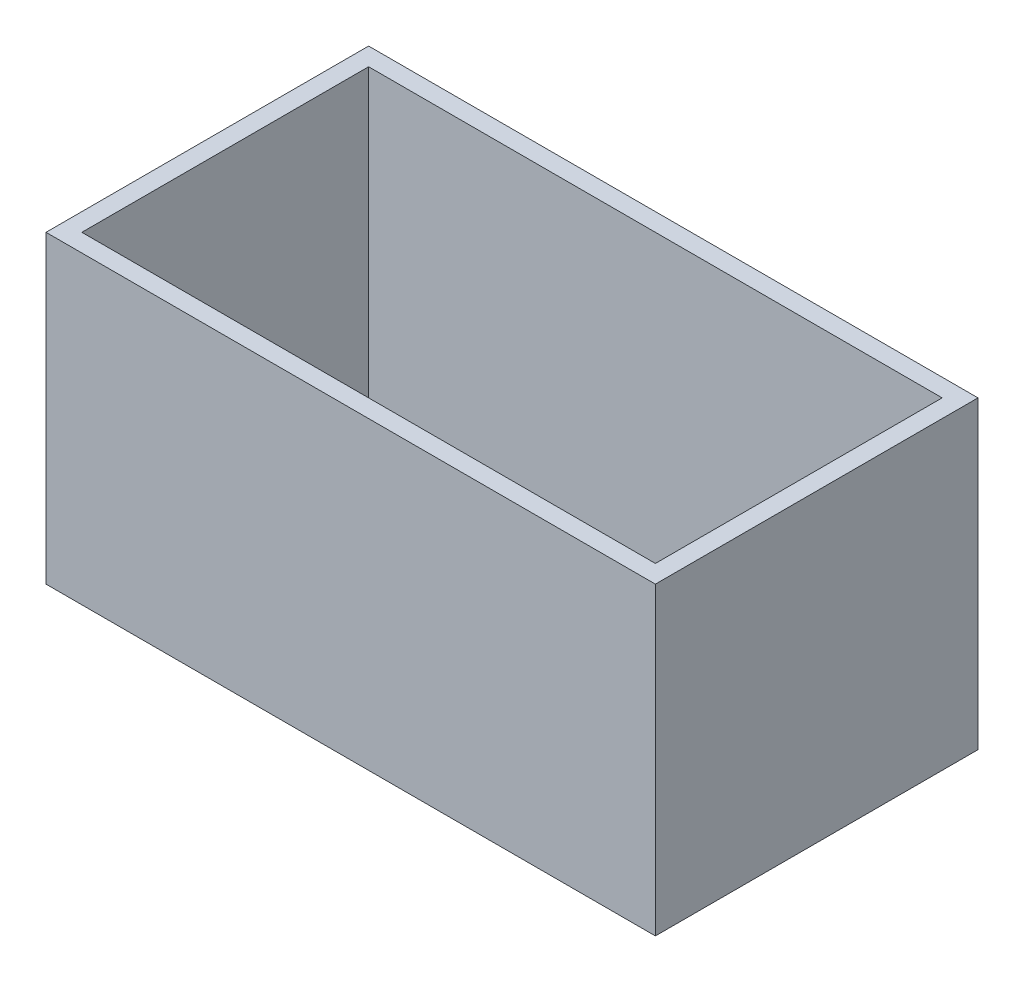
ISO-10303-21;
HEADER;
FILE_DESCRIPTION(('STEP AP214'),'2;1');
FILE_NAME('part.step','',(''),(''),'','','');
FILE_SCHEMA(('AUTOMOTIVE_DESIGN { 1 0 10303 214 1 1 1 1 }'));
ENDSEC;
DATA;
#1=APPLICATION_CONTEXT('core data for automotive mechanical design processes');
#2=APPLICATION_PROTOCOL_DEFINITION('international standard','automotive_design',2000,#1);
#3=PRODUCT_CONTEXT('',#1,'mechanical');
#4=PRODUCT('Part','Part','',(#3));
#5=PRODUCT_RELATED_PRODUCT_CATEGORY('part','',(#4));
#6=PRODUCT_DEFINITION_FORMATION('','',#4);
#7=PRODUCT_DEFINITION_CONTEXT('part definition',#1,'design');
#8=PRODUCT_DEFINITION('design','',#6,#7);
#9=PRODUCT_DEFINITION_SHAPE('','',#8);
#10=(LENGTH_UNIT() NAMED_UNIT(*) SI_UNIT(.MILLI.,.METRE.));
#11=(NAMED_UNIT(*) PLANE_ANGLE_UNIT() SI_UNIT($,.RADIAN.));
#12=(NAMED_UNIT(*) SI_UNIT($,.STERADIAN.) SOLID_ANGLE_UNIT());
#13=UNCERTAINTY_MEASURE_WITH_UNIT(LENGTH_MEASURE(1.E-05),#10,'distance_accuracy_value','');
#14=(GEOMETRIC_REPRESENTATION_CONTEXT(3) GLOBAL_UNCERTAINTY_ASSIGNED_CONTEXT((#13)) GLOBAL_UNIT_ASSIGNED_CONTEXT((#10,
#11,#12)) REPRESENTATION_CONTEXT('',''));
#15=CARTESIAN_POINT('',(0.,0.,0.));
#16=DIRECTION('',(0.,0.,1.));
#17=DIRECTION('',(1.,0.,0.));
#18=AXIS2_PLACEMENT_3D('',#15,#16,#17);
#19=CARTESIAN_POINT('',(0.,323.85,0.));
#20=DIRECTION('',(0.,-1.,0.));
#21=DIRECTION('',(0.,0.,-1.));
#22=AXIS2_PLACEMENT_3D('',#19,#20,#21);
#23=PLANE('',#22);
#24=DIRECTION('',(1.,0.,0.));
#25=VECTOR('',#24,1.);
#26=CARTESIAN_POINT('',(-323.85,323.85,171.45));
#27=LINE('',#26,#25);
#28=CARTESIAN_POINT('',(-323.85,323.85,171.45));
#29=VERTEX_POINT('',#28);
#30=CARTESIAN_POINT('',(323.85,323.85,171.45));
#31=VERTEX_POINT('',#30);
#32=EDGE_CURVE('E89',#29,#31,#27,.T.);
#33=ORIENTED_EDGE('',*,*,#32,.T.);
#34=DIRECTION('',(0.,0.,1.));
#35=VECTOR('',#34,1.);
#36=CARTESIAN_POINT('',(323.85,323.85,-171.45));
#37=LINE('',#36,#35);
#38=CARTESIAN_POINT('',(323.85,323.85,-171.45));
#39=VERTEX_POINT('',#38);
#40=EDGE_CURVE('E167',#39,#31,#37,.T.);
#41=ORIENTED_EDGE('',*,*,#40,.F.);
#42=DIRECTION('',(1.,0.,0.));
#43=VECTOR('',#42,1.);
#44=CARTESIAN_POINT('',(-323.85,323.85,-171.45));
#45=LINE('',#44,#43);
#46=CARTESIAN_POINT('',(-323.85,323.85,-171.45));
#47=VERTEX_POINT('',#46);
#48=EDGE_CURVE('E171',#47,#39,#45,.T.);
#49=ORIENTED_EDGE('',*,*,#48,.F.);
#50=DIRECTION('',(0.,0.,1.));
#51=VECTOR('',#50,1.);
#52=CARTESIAN_POINT('',(-323.85,323.85,-171.45));
#53=LINE('',#52,#51);
#54=EDGE_CURVE('E64',#47,#29,#53,.T.);
#55=ORIENTED_EDGE('',*,*,#54,.T.);
#56=EDGE_LOOP('',(#33,#41,#49,#55));
#57=FACE_BOUND('',#56,.T.);
#58=DIRECTION('',(1.,0.,0.));
#59=VECTOR('',#58,1.);
#60=CARTESIAN_POINT('',(0.,323.85,152.4));
#61=LINE('',#60,#59);
#62=CARTESIAN_POINT('',(-304.8,323.85,152.4));
#63=VERTEX_POINT('',#62);
#64=CARTESIAN_POINT('',(304.8,323.85,152.4));
#65=VERTEX_POINT('',#64);
#66=EDGE_CURVE('E119',#63,#65,#61,.T.);
#67=ORIENTED_EDGE('',*,*,#66,.F.);
#68=DIRECTION('',(0.,0.,1.));
#69=VECTOR('',#68,1.);
#70=CARTESIAN_POINT('',(-304.8,323.85,0.));
#71=LINE('',#70,#69);
#72=CARTESIAN_POINT('',(-304.8,323.85,-152.4));
#73=VERTEX_POINT('',#72);
#74=EDGE_CURVE('E162',#73,#63,#71,.T.);
#75=ORIENTED_EDGE('',*,*,#74,.F.);
#76=DIRECTION('',(1.,0.,0.));
#77=VECTOR('',#76,1.);
#78=CARTESIAN_POINT('',(0.,323.85,-152.4));
#79=LINE('',#78,#77);
#80=CARTESIAN_POINT('',(304.8,323.85,-152.4));
#81=VERTEX_POINT('',#80);
#82=EDGE_CURVE('E55',#73,#81,#79,.T.);
#83=ORIENTED_EDGE('',*,*,#82,.T.);
#84=DIRECTION('',(0.,0.,1.));
#85=VECTOR('',#84,1.);
#86=CARTESIAN_POINT('',(304.8,323.85,0.));
#87=LINE('',#86,#85);
#88=EDGE_CURVE('E157',#81,#65,#87,.T.);
#89=ORIENTED_EDGE('',*,*,#88,.T.);
#90=EDGE_LOOP('',(#67,#75,#83,#89));
#91=FACE_BOUND('',#90,.T.);
#92=ADVANCED_FACE('F39',(#57,#91),#23,.F.);
#93=CARTESIAN_POINT('',(-323.85,323.85,171.45));
#94=DIRECTION('',(0.,0.,-1.));
#95=DIRECTION('',(-1.,0.,0.));
#96=AXIS2_PLACEMENT_3D('',#93,#94,#95);
#97=PLANE('',#96);
#98=DIRECTION('',(1.,0.,0.));
#99=VECTOR('',#98,1.);
#100=CARTESIAN_POINT('',(-323.85,0.,171.45));
#101=LINE('',#100,#99);
#102=CARTESIAN_POINT('',(-323.85,0.,171.45));
#103=VERTEX_POINT('',#102);
#104=CARTESIAN_POINT('',(323.85,0.,171.45));
#105=VERTEX_POINT('',#104);
#106=EDGE_CURVE('E125',#103,#105,#101,.T.);
#107=ORIENTED_EDGE('',*,*,#106,.T.);
#108=DIRECTION('',(0.,-1.,0.));
#109=VECTOR('',#108,1.);
#110=CARTESIAN_POINT('',(323.85,323.85,171.45));
#111=LINE('',#110,#109);
#112=EDGE_CURVE('E11',#31,#105,#111,.T.);
#113=ORIENTED_EDGE('',*,*,#112,.F.);
#114=ORIENTED_EDGE('',*,*,#32,.F.);
#115=DIRECTION('',(0.,-1.,0.));
#116=VECTOR('',#115,1.);
#117=CARTESIAN_POINT('',(-323.85,323.85,171.45));
#118=LINE('',#117,#116);
#119=EDGE_CURVE('E177',#29,#103,#118,.T.);
#120=ORIENTED_EDGE('',*,*,#119,.T.);
#121=EDGE_LOOP('',(#107,#113,#114,#120));
#122=FACE_BOUND('',#121,.T.);
#123=ADVANCED_FACE('F41',(#122),#97,.F.);
#124=CARTESIAN_POINT('',(323.85,323.85,-171.45));
#125=DIRECTION('',(1.,0.,0.));
#126=DIRECTION('',(0.,0.,-1.));
#127=AXIS2_PLACEMENT_3D('',#124,#125,#126);
#128=PLANE('',#127);
#129=DIRECTION('',(0.,0.,1.));
#130=VECTOR('',#129,1.);
#131=CARTESIAN_POINT('',(323.85,0.,-171.45));
#132=LINE('',#131,#130);
#133=CARTESIAN_POINT('',(323.85,0.,-171.45));
#134=VERTEX_POINT('',#133);
#135=EDGE_CURVE('E181',#134,#105,#132,.T.);
#136=ORIENTED_EDGE('',*,*,#135,.F.);
#137=DIRECTION('',(0.,-1.,0.));
#138=VECTOR('',#137,1.);
#139=CARTESIAN_POINT('',(323.85,323.85,-171.45));
#140=LINE('',#139,#138);
#141=EDGE_CURVE('E48',#39,#134,#140,.T.);
#142=ORIENTED_EDGE('',*,*,#141,.F.);
#143=ORIENTED_EDGE('',*,*,#40,.T.);
#144=ORIENTED_EDGE('',*,*,#112,.T.);
#145=EDGE_LOOP('',(#136,#142,#143,#144));
#146=FACE_BOUND('',#145,.T.);
#147=ADVANCED_FACE('F201',(#146),#128,.T.);
#148=CARTESIAN_POINT('',(-323.85,323.85,-171.45));
#149=DIRECTION('',(0.,0.,-1.));
#150=DIRECTION('',(-1.,0.,0.));
#151=AXIS2_PLACEMENT_3D('',#148,#149,#150);
#152=PLANE('',#151);
#153=DIRECTION('',(1.,0.,0.));
#154=VECTOR('',#153,1.);
#155=CARTESIAN_POINT('',(-323.85,0.,-171.45));
#156=LINE('',#155,#154);
#157=CARTESIAN_POINT('',(-323.85,0.,-171.45));
#158=VERTEX_POINT('',#157);
#159=EDGE_CURVE('E185',#158,#134,#156,.T.);
#160=ORIENTED_EDGE('',*,*,#159,.F.);
#161=DIRECTION('',(0.,-1.,0.));
#162=VECTOR('',#161,1.);
#163=CARTESIAN_POINT('',(-323.85,323.85,-171.45));
#164=LINE('',#163,#162);
#165=EDGE_CURVE('E193',#47,#158,#164,.T.);
#166=ORIENTED_EDGE('',*,*,#165,.F.);
#167=ORIENTED_EDGE('',*,*,#48,.T.);
#168=ORIENTED_EDGE('',*,*,#141,.T.);
#169=EDGE_LOOP('',(#160,#166,#167,#168));
#170=FACE_BOUND('',#169,.T.);
#171=ADVANCED_FACE('F199',(#170),#152,.T.);
#172=CARTESIAN_POINT('',(-323.85,323.85,-171.45));
#173=DIRECTION('',(1.,0.,0.));
#174=DIRECTION('',(0.,0.,-1.));
#175=AXIS2_PLACEMENT_3D('',#172,#173,#174);
#176=PLANE('',#175);
#177=DIRECTION('',(0.,0.,1.));
#178=VECTOR('',#177,1.);
#179=CARTESIAN_POINT('',(-323.85,0.,-171.45));
#180=LINE('',#179,#178);
#181=EDGE_CURVE('E84',#158,#103,#180,.T.);
#182=ORIENTED_EDGE('',*,*,#181,.T.);
#183=ORIENTED_EDGE('',*,*,#119,.F.);
#184=ORIENTED_EDGE('',*,*,#54,.F.);
#185=ORIENTED_EDGE('',*,*,#165,.T.);
#186=EDGE_LOOP('',(#182,#183,#184,#185));
#187=FACE_BOUND('',#186,.T.);
#188=ADVANCED_FACE('F206',(#187),#176,.F.);
#189=CARTESIAN_POINT('',(0.,0.,0.));
#190=DIRECTION('',(0.,-1.,0.));
#191=DIRECTION('',(0.,0.,-1.));
#192=AXIS2_PLACEMENT_3D('',#189,#190,#191);
#193=PLANE('',#192);
#194=ORIENTED_EDGE('',*,*,#106,.F.);
#195=ORIENTED_EDGE('',*,*,#181,.F.);
#196=ORIENTED_EDGE('',*,*,#159,.T.);
#197=ORIENTED_EDGE('',*,*,#135,.T.);
#198=EDGE_LOOP('',(#194,#195,#196,#197));
#199=FACE_BOUND('',#198,.T.);
#200=ADVANCED_FACE('F204',(#199),#193,.T.);
#201=CARTESIAN_POINT('',(-323.85,323.85,152.4));
#202=DIRECTION('',(0.,0.,-1.));
#203=DIRECTION('',(-1.,0.,0.));
#204=AXIS2_PLACEMENT_3D('',#201,#202,#203);
#205=PLANE('',#204);
#206=DIRECTION('',(1.,0.,0.));
#207=VECTOR('',#206,1.);
#208=CARTESIAN_POINT('',(0.,19.05,152.4));
#209=LINE('',#208,#207);
#210=CARTESIAN_POINT('',(-304.8,19.05,152.4));
#211=VERTEX_POINT('',#210);
#212=CARTESIAN_POINT('',(304.8,19.05,152.4));
#213=VERTEX_POINT('',#212);
#214=EDGE_CURVE('E117',#211,#213,#209,.T.);
#215=ORIENTED_EDGE('',*,*,#214,.F.);
#216=DIRECTION('',(0.,-1.,0.));
#217=VECTOR('',#216,1.);
#218=CARTESIAN_POINT('',(-304.8,323.85,152.4));
#219=LINE('',#218,#217);
#220=EDGE_CURVE('E147',#63,#211,#219,.T.);
#221=ORIENTED_EDGE('',*,*,#220,.F.);
#222=ORIENTED_EDGE('',*,*,#66,.T.);
#223=DIRECTION('',(0.,-1.,0.));
#224=VECTOR('',#223,1.);
#225=CARTESIAN_POINT('',(304.8,323.85,152.4));
#226=LINE('',#225,#224);
#227=EDGE_CURVE('E113',#65,#213,#226,.T.);
#228=ORIENTED_EDGE('',*,*,#227,.T.);
#229=EDGE_LOOP('',(#215,#221,#222,#228));
#230=FACE_BOUND('',#229,.T.);
#231=ADVANCED_FACE('F115',(#230),#205,.T.);
#232=CARTESIAN_POINT('',(304.8,323.85,-171.45));
#233=DIRECTION('',(1.,0.,0.));
#234=DIRECTION('',(0.,0.,-1.));
#235=AXIS2_PLACEMENT_3D('',#232,#233,#234);
#236=PLANE('',#235);
#237=DIRECTION('',(0.,0.,1.));
#238=VECTOR('',#237,1.);
#239=CARTESIAN_POINT('',(304.8,19.05,0.));
#240=LINE('',#239,#238);
#241=CARTESIAN_POINT('',(304.8,19.05,-152.4));
#242=VERTEX_POINT('',#241);
#243=EDGE_CURVE('E132',#242,#213,#240,.T.);
#244=ORIENTED_EDGE('',*,*,#243,.T.);
#245=ORIENTED_EDGE('',*,*,#227,.F.);
#246=ORIENTED_EDGE('',*,*,#88,.F.);
#247=DIRECTION('',(0.,-1.,0.));
#248=VECTOR('',#247,1.);
#249=CARTESIAN_POINT('',(304.8,323.85,-152.4));
#250=LINE('',#249,#248);
#251=EDGE_CURVE('E126',#81,#242,#250,.T.);
#252=ORIENTED_EDGE('',*,*,#251,.T.);
#253=EDGE_LOOP('',(#244,#245,#246,#252));
#254=FACE_BOUND('',#253,.T.);
#255=ADVANCED_FACE('F139',(#254),#236,.F.);
#256=CARTESIAN_POINT('',(-323.85,323.85,-152.4));
#257=DIRECTION('',(0.,0.,-1.));
#258=DIRECTION('',(-1.,0.,0.));
#259=AXIS2_PLACEMENT_3D('',#256,#257,#258);
#260=PLANE('',#259);
#261=DIRECTION('',(1.,0.,0.));
#262=VECTOR('',#261,1.);
#263=CARTESIAN_POINT('',(0.,19.05,-152.4));
#264=LINE('',#263,#262);
#265=CARTESIAN_POINT('',(-304.8,19.05,-152.4));
#266=VERTEX_POINT('',#265);
#267=EDGE_CURVE('E141',#266,#242,#264,.T.);
#268=ORIENTED_EDGE('',*,*,#267,.T.);
#269=ORIENTED_EDGE('',*,*,#251,.F.);
#270=ORIENTED_EDGE('',*,*,#82,.F.);
#271=DIRECTION('',(0.,-1.,0.));
#272=VECTOR('',#271,1.);
#273=CARTESIAN_POINT('',(-304.8,323.85,-152.4));
#274=LINE('',#273,#272);
#275=EDGE_CURVE('E149',#73,#266,#274,.T.);
#276=ORIENTED_EDGE('',*,*,#275,.T.);
#277=EDGE_LOOP('',(#268,#269,#270,#276));
#278=FACE_BOUND('',#277,.T.);
#279=ADVANCED_FACE('F214',(#278),#260,.F.);
#280=CARTESIAN_POINT('',(-304.8,323.85,-171.45));
#281=DIRECTION('',(1.,0.,0.));
#282=DIRECTION('',(0.,0.,-1.));
#283=AXIS2_PLACEMENT_3D('',#280,#281,#282);
#284=PLANE('',#283);
#285=DIRECTION('',(0.,0.,1.));
#286=VECTOR('',#285,1.);
#287=CARTESIAN_POINT('',(-304.8,19.05,0.));
#288=LINE('',#287,#286);
#289=EDGE_CURVE('E135',#266,#211,#288,.T.);
#290=ORIENTED_EDGE('',*,*,#289,.F.);
#291=ORIENTED_EDGE('',*,*,#275,.F.);
#292=ORIENTED_EDGE('',*,*,#74,.T.);
#293=ORIENTED_EDGE('',*,*,#220,.T.);
#294=EDGE_LOOP('',(#290,#291,#292,#293));
#295=FACE_BOUND('',#294,.T.);
#296=ADVANCED_FACE('F212',(#295),#284,.T.);
#297=CARTESIAN_POINT('',(0.,19.05,0.));
#298=DIRECTION('',(0.,-1.,0.));
#299=DIRECTION('',(0.,0.,-1.));
#300=AXIS2_PLACEMENT_3D('',#297,#298,#299);
#301=PLANE('',#300);
#302=ORIENTED_EDGE('',*,*,#214,.T.);
#303=ORIENTED_EDGE('',*,*,#243,.F.);
#304=ORIENTED_EDGE('',*,*,#267,.F.);
#305=ORIENTED_EDGE('',*,*,#289,.T.);
#306=EDGE_LOOP('',(#302,#303,#304,#305));
#307=FACE_BOUND('',#306,.T.);
#308=ADVANCED_FACE('F130',(#307),#301,.F.);
#309=CLOSED_SHELL('',(#92,#123,#147,#171,#188,#200,#231,#255,#279,#296,#308));
#310=MANIFOLD_SOLID_BREP('B2',#309);
#311=ADVANCED_BREP_SHAPE_REPRESENTATION('',(#18,#310),#14);
#312=SHAPE_DEFINITION_REPRESENTATION(#9,#311);
ENDSEC;
END-ISO-10303-21;
